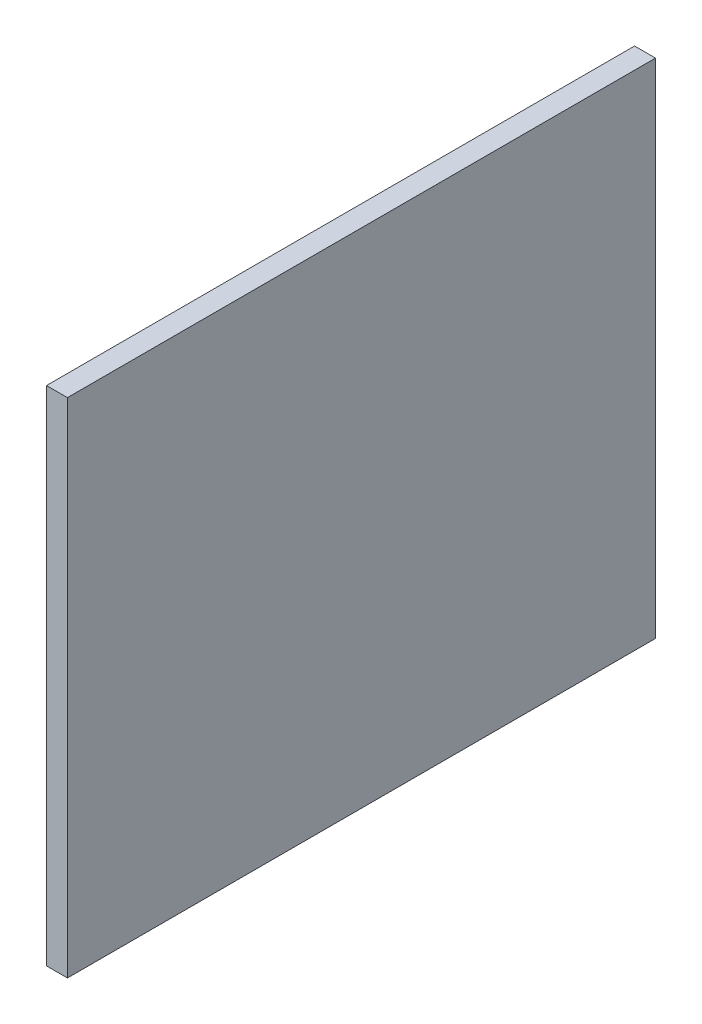
ISO-10303-21;
HEADER;
FILE_DESCRIPTION(('STEP AP214'),'2;1');
FILE_NAME('part.step','',(''),(''),'','','');
FILE_SCHEMA(('AUTOMOTIVE_DESIGN { 1 0 10303 214 1 1 1 1 }'));
ENDSEC;
DATA;
#1=APPLICATION_CONTEXT('core data for automotive mechanical design processes');
#2=APPLICATION_PROTOCOL_DEFINITION('international standard','automotive_design',2000,#1);
#3=PRODUCT_CONTEXT('',#1,'mechanical');
#4=PRODUCT('Part','Part','',(#3));
#5=PRODUCT_RELATED_PRODUCT_CATEGORY('part','',(#4));
#6=PRODUCT_DEFINITION_FORMATION('','',#4);
#7=PRODUCT_DEFINITION_CONTEXT('part definition',#1,'design');
#8=PRODUCT_DEFINITION('design','',#6,#7);
#9=PRODUCT_DEFINITION_SHAPE('','',#8);
#10=(LENGTH_UNIT() NAMED_UNIT(*) SI_UNIT(.MILLI.,.METRE.));
#11=(NAMED_UNIT(*) PLANE_ANGLE_UNIT() SI_UNIT($,.RADIAN.));
#12=(NAMED_UNIT(*) SI_UNIT($,.STERADIAN.) SOLID_ANGLE_UNIT());
#13=UNCERTAINTY_MEASURE_WITH_UNIT(LENGTH_MEASURE(1.E-05),#10,'distance_accuracy_value','');
#14=(GEOMETRIC_REPRESENTATION_CONTEXT(3) GLOBAL_UNCERTAINTY_ASSIGNED_CONTEXT((#13)) GLOBAL_UNIT_ASSIGNED_CONTEXT((#10,
#11,#12)) REPRESENTATION_CONTEXT('',''));
#15=CARTESIAN_POINT('',(0.,0.,0.));
#16=DIRECTION('',(0.,0.,1.));
#17=DIRECTION('',(1.,0.,0.));
#18=AXIS2_PLACEMENT_3D('',#15,#16,#17);
#19=CARTESIAN_POINT('',(3.175,0.,0.));
#20=DIRECTION('',(0.,0.,-1.));
#21=DIRECTION('',(-1.,0.,0.));
#22=AXIS2_PLACEMENT_3D('',#19,#20,#21);
#23=PLANE('',#22);
#24=DIRECTION('',(0.,-1.,0.));
#25=VECTOR('',#24,1.);
#26=CARTESIAN_POINT('',(0.,0.,0.));
#27=LINE('',#26,#25);
#28=CARTESIAN_POINT('',(0.,76.2,0.));
#29=VERTEX_POINT('',#28);
#30=CARTESIAN_POINT('',(0.,0.,0.));
#31=VERTEX_POINT('',#30);
#32=EDGE_CURVE('E96',#29,#31,#27,.T.);
#33=ORIENTED_EDGE('',*,*,#32,.T.);
#34=DIRECTION('',(-1.,0.,0.));
#35=VECTOR('',#34,1.);
#36=CARTESIAN_POINT('',(3.175,0.,0.));
#37=LINE('',#36,#35);
#38=CARTESIAN_POINT('',(3.175,0.,0.));
#39=VERTEX_POINT('',#38);
#40=EDGE_CURVE('E11',#39,#31,#37,.T.);
#41=ORIENTED_EDGE('',*,*,#40,.F.);
#42=DIRECTION('',(0.,-1.,0.));
#43=VECTOR('',#42,1.);
#44=CARTESIAN_POINT('',(3.175,0.,0.));
#45=LINE('',#44,#43);
#46=CARTESIAN_POINT('',(3.175,76.2,0.));
#47=VERTEX_POINT('',#46);
#48=EDGE_CURVE('E84',#47,#39,#45,.T.);
#49=ORIENTED_EDGE('',*,*,#48,.F.);
#50=DIRECTION('',(-1.,0.,0.));
#51=VECTOR('',#50,1.);
#52=CARTESIAN_POINT('',(3.175,76.2,0.));
#53=LINE('',#52,#51);
#54=EDGE_CURVE('E92',#47,#29,#53,.T.);
#55=ORIENTED_EDGE('',*,*,#54,.T.);
#56=EDGE_LOOP('',(#33,#41,#49,#55));
#57=FACE_BOUND('',#56,.T.);
#58=ADVANCED_FACE('F33',(#57),#23,.F.);
#59=CARTESIAN_POINT('',(3.175,0.,0.));
#60=DIRECTION('',(0.,1.,0.));
#61=DIRECTION('',(0.,0.,1.));
#62=AXIS2_PLACEMENT_3D('',#59,#60,#61);
#63=PLANE('',#62);
#64=DIRECTION('',(0.,0.,-1.));
#65=VECTOR('',#64,1.);
#66=CARTESIAN_POINT('',(0.,0.,0.));
#67=LINE('',#66,#65);
#68=CARTESIAN_POINT('',(0.,0.,-89.154));
#69=VERTEX_POINT('',#68);
#70=EDGE_CURVE('E88',#31,#69,#67,.T.);
#71=ORIENTED_EDGE('',*,*,#70,.T.);
#72=DIRECTION('',(-1.,0.,0.));
#73=VECTOR('',#72,1.);
#74=CARTESIAN_POINT('',(3.175,0.,-89.154));
#75=LINE('',#74,#73);
#76=CARTESIAN_POINT('',(3.175,0.,-89.154));
#77=VERTEX_POINT('',#76);
#78=EDGE_CURVE('E41',#77,#69,#75,.T.);
#79=ORIENTED_EDGE('',*,*,#78,.F.);
#80=DIRECTION('',(0.,0.,-1.));
#81=VECTOR('',#80,1.);
#82=CARTESIAN_POINT('',(3.175,0.,0.));
#83=LINE('',#82,#81);
#84=EDGE_CURVE('E79',#39,#77,#83,.T.);
#85=ORIENTED_EDGE('',*,*,#84,.F.);
#86=ORIENTED_EDGE('',*,*,#40,.T.);
#87=EDGE_LOOP('',(#71,#79,#85,#86));
#88=FACE_BOUND('',#87,.T.);
#89=ADVANCED_FACE('F87',(#88),#63,.F.);
#90=CARTESIAN_POINT('',(3.175,0.,-89.154));
#91=DIRECTION('',(0.,0.,1.));
#92=DIRECTION('',(1.,0.,0.));
#93=AXIS2_PLACEMENT_3D('',#90,#91,#92);
#94=PLANE('',#93);
#95=DIRECTION('',(0.,1.,0.));
#96=VECTOR('',#95,1.);
#97=CARTESIAN_POINT('',(0.,0.,-89.154));
#98=LINE('',#97,#96);
#99=CARTESIAN_POINT('',(0.,76.2,-89.154));
#100=VERTEX_POINT('',#99);
#101=EDGE_CURVE('E66',#69,#100,#98,.T.);
#102=ORIENTED_EDGE('',*,*,#101,.T.);
#103=DIRECTION('',(-1.,0.,0.));
#104=VECTOR('',#103,1.);
#105=CARTESIAN_POINT('',(3.175,76.2,-89.154));
#106=LINE('',#105,#104);
#107=CARTESIAN_POINT('',(3.175,76.2,-89.154));
#108=VERTEX_POINT('',#107);
#109=EDGE_CURVE('E89',#108,#100,#106,.T.);
#110=ORIENTED_EDGE('',*,*,#109,.F.);
#111=DIRECTION('',(0.,1.,0.));
#112=VECTOR('',#111,1.);
#113=CARTESIAN_POINT('',(3.175,0.,-89.154));
#114=LINE('',#113,#112);
#115=EDGE_CURVE('E82',#77,#108,#114,.T.);
#116=ORIENTED_EDGE('',*,*,#115,.F.);
#117=ORIENTED_EDGE('',*,*,#78,.T.);
#118=EDGE_LOOP('',(#102,#110,#116,#117));
#119=FACE_BOUND('',#118,.T.);
#120=ADVANCED_FACE('F90',(#119),#94,.F.);
#121=CARTESIAN_POINT('',(3.175,76.2,0.));
#122=DIRECTION('',(0.,-1.,0.));
#123=DIRECTION('',(0.,0.,-1.));
#124=AXIS2_PLACEMENT_3D('',#121,#122,#123);
#125=PLANE('',#124);
#126=DIRECTION('',(0.,0.,1.));
#127=VECTOR('',#126,1.);
#128=CARTESIAN_POINT('',(0.,76.2,0.));
#129=LINE('',#128,#127);
#130=EDGE_CURVE('E72',#100,#29,#129,.T.);
#131=ORIENTED_EDGE('',*,*,#130,.T.);
#132=ORIENTED_EDGE('',*,*,#54,.F.);
#133=DIRECTION('',(0.,0.,1.));
#134=VECTOR('',#133,1.);
#135=CARTESIAN_POINT('',(3.175,76.2,0.));
#136=LINE('',#135,#134);
#137=EDGE_CURVE('E49',#108,#47,#136,.T.);
#138=ORIENTED_EDGE('',*,*,#137,.F.);
#139=ORIENTED_EDGE('',*,*,#109,.T.);
#140=EDGE_LOOP('',(#131,#132,#138,#139));
#141=FACE_BOUND('',#140,.T.);
#142=ADVANCED_FACE('F103',(#141),#125,.F.);
#143=CARTESIAN_POINT('',(3.175,0.,0.));
#144=DIRECTION('',(-1.,0.,0.));
#145=DIRECTION('',(0.,0.,1.));
#146=AXIS2_PLACEMENT_3D('',#143,#144,#145);
#147=PLANE('',#146);
#148=ORIENTED_EDGE('',*,*,#48,.T.);
#149=ORIENTED_EDGE('',*,*,#84,.T.);
#150=ORIENTED_EDGE('',*,*,#115,.T.);
#151=ORIENTED_EDGE('',*,*,#137,.T.);
#152=EDGE_LOOP('',(#148,#149,#150,#151));
#153=FACE_BOUND('',#152,.T.);
#154=ADVANCED_FACE('F80',(#153),#147,.F.);
#155=CARTESIAN_POINT('',(0.,0.,0.));
#156=DIRECTION('',(-1.,0.,0.));
#157=DIRECTION('',(0.,0.,1.));
#158=AXIS2_PLACEMENT_3D('',#155,#156,#157);
#159=PLANE('',#158);
#160=ORIENTED_EDGE('',*,*,#32,.F.);
#161=ORIENTED_EDGE('',*,*,#130,.F.);
#162=ORIENTED_EDGE('',*,*,#101,.F.);
#163=ORIENTED_EDGE('',*,*,#70,.F.);
#164=EDGE_LOOP('',(#160,#161,#162,#163));
#165=FACE_BOUND('',#164,.T.);
#166=ADVANCED_FACE('F106',(#165),#159,.T.);
#167=CLOSED_SHELL('',(#58,#89,#120,#142,#154,#166));
#168=MANIFOLD_SOLID_BREP('B2',#167);
#169=ADVANCED_BREP_SHAPE_REPRESENTATION('',(#18,#168),#14);
#170=SHAPE_DEFINITION_REPRESENTATION(#9,#169);
ENDSEC;
END-ISO-10303-21;
